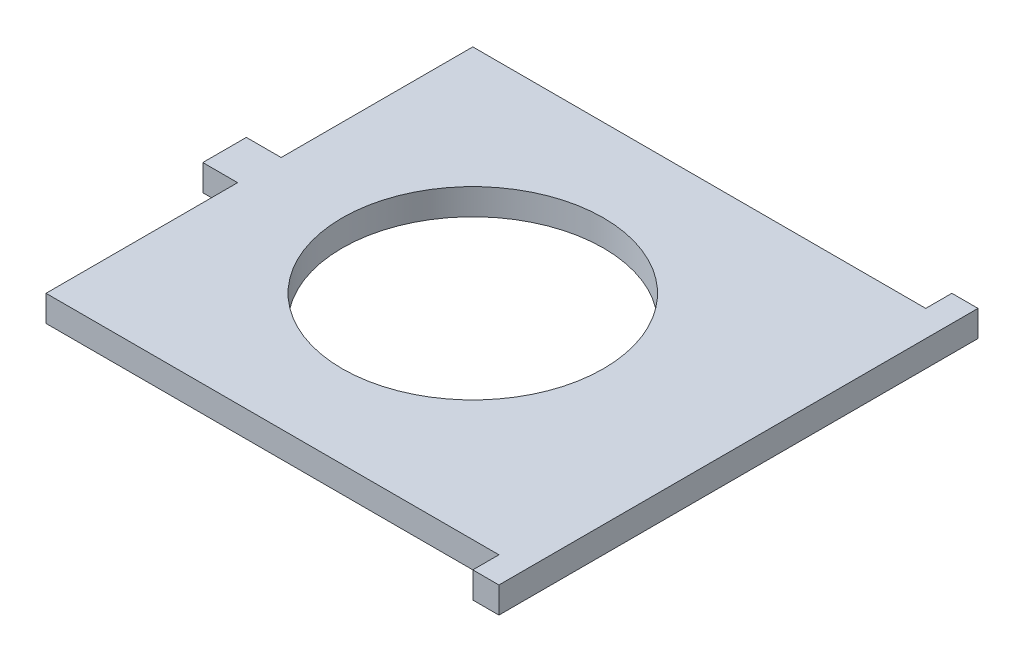
ISO-10303-21;
HEADER;
FILE_DESCRIPTION(('STEP AP214'),'2;1');
FILE_NAME('part.step','',(''),(''),'','','');
FILE_SCHEMA(('AUTOMOTIVE_DESIGN { 1 0 10303 214 1 1 1 1 }'));
ENDSEC;
DATA;
#1=APPLICATION_CONTEXT('core data for automotive mechanical design processes');
#2=APPLICATION_PROTOCOL_DEFINITION('international standard','automotive_design',2000,#1);
#3=PRODUCT_CONTEXT('',#1,'mechanical');
#4=PRODUCT('Part','Part','',(#3));
#5=PRODUCT_RELATED_PRODUCT_CATEGORY('part','',(#4));
#6=PRODUCT_DEFINITION_FORMATION('','',#4);
#7=PRODUCT_DEFINITION_CONTEXT('part definition',#1,'design');
#8=PRODUCT_DEFINITION('design','',#6,#7);
#9=PRODUCT_DEFINITION_SHAPE('','',#8);
#10=(LENGTH_UNIT() NAMED_UNIT(*) SI_UNIT(.MILLI.,.METRE.));
#11=(NAMED_UNIT(*) PLANE_ANGLE_UNIT() SI_UNIT($,.RADIAN.));
#12=(NAMED_UNIT(*) SI_UNIT($,.STERADIAN.) SOLID_ANGLE_UNIT());
#13=UNCERTAINTY_MEASURE_WITH_UNIT(LENGTH_MEASURE(1.E-05),#10,'distance_accuracy_value','');
#14=(GEOMETRIC_REPRESENTATION_CONTEXT(3) GLOBAL_UNCERTAINTY_ASSIGNED_CONTEXT((#13)) GLOBAL_UNIT_ASSIGNED_CONTEXT((#10,
#11,#12)) REPRESENTATION_CONTEXT('',''));
#15=CARTESIAN_POINT('',(0.,0.,0.));
#16=DIRECTION('',(0.,0.,1.));
#17=DIRECTION('',(1.,0.,0.));
#18=AXIS2_PLACEMENT_3D('',#15,#16,#17);
#19=CARTESIAN_POINT('',(0.,3.,24.5));
#20=DIRECTION('',(0.,0.,-1.));
#21=DIRECTION('',(-1.,0.,0.));
#22=AXIS2_PLACEMENT_3D('',#19,#20,#21);
#23=PLANE('',#22);
#24=DIRECTION('',(1.,0.,0.));
#25=VECTOR('',#24,1.);
#26=CARTESIAN_POINT('',(0.,0.,24.5));
#27=LINE('',#26,#25);
#28=CARTESIAN_POINT('',(-24.5,0.,24.5));
#29=VERTEX_POINT('',#28);
#30=CARTESIAN_POINT('',(27.5,0.,24.5));
#31=VERTEX_POINT('',#30);
#32=EDGE_CURVE('E163',#29,#31,#27,.T.);
#33=ORIENTED_EDGE('',*,*,#32,.T.);
#34=DIRECTION('',(0.,-1.,0.));
#35=VECTOR('',#34,1.);
#36=CARTESIAN_POINT('',(27.5,3.,24.5));
#37=LINE('',#36,#35);
#38=CARTESIAN_POINT('',(27.5,3.,24.5));
#39=VERTEX_POINT('',#38);
#40=EDGE_CURVE('E11',#39,#31,#37,.T.);
#41=ORIENTED_EDGE('',*,*,#40,.F.);
#42=DIRECTION('',(1.,0.,0.));
#43=VECTOR('',#42,1.);
#44=CARTESIAN_POINT('',(0.,3.,24.5));
#45=LINE('',#44,#43);
#46=CARTESIAN_POINT('',(-24.5,3.,24.5));
#47=VERTEX_POINT('',#46);
#48=EDGE_CURVE('E448',#47,#39,#45,.T.);
#49=ORIENTED_EDGE('',*,*,#48,.F.);
#50=DIRECTION('',(0.,-1.,0.));
#51=VECTOR('',#50,1.);
#52=CARTESIAN_POINT('',(-24.5,3.,24.5));
#53=LINE('',#52,#51);
#54=EDGE_CURVE('E54',#47,#29,#53,.T.);
#55=ORIENTED_EDGE('',*,*,#54,.T.);
#56=EDGE_LOOP('',(#33,#41,#49,#55));
#57=FACE_BOUND('',#56,.T.);
#58=ADVANCED_FACE('F37',(#57),#23,.F.);
#59=CARTESIAN_POINT('',(27.5,3.,0.));
#60=DIRECTION('',(1.,0.,0.));
#61=DIRECTION('',(0.,0.,-1.));
#62=AXIS2_PLACEMENT_3D('',#59,#60,#61);
#63=PLANE('',#62);
#64=DIRECTION('',(0.,0.,1.));
#65=VECTOR('',#64,1.);
#66=CARTESIAN_POINT('',(27.5,0.,0.));
#67=LINE('',#66,#65);
#68=CARTESIAN_POINT('',(27.5,0.,27.5));
#69=VERTEX_POINT('',#68);
#70=EDGE_CURVE('E165',#31,#69,#67,.T.);
#71=ORIENTED_EDGE('',*,*,#70,.T.);
#72=DIRECTION('',(0.,-1.,0.));
#73=VECTOR('',#72,1.);
#74=CARTESIAN_POINT('',(27.5,3.,27.5));
#75=LINE('',#74,#73);
#76=CARTESIAN_POINT('',(27.5,3.,27.5));
#77=VERTEX_POINT('',#76);
#78=EDGE_CURVE('E46',#77,#69,#75,.T.);
#79=ORIENTED_EDGE('',*,*,#78,.F.);
#80=DIRECTION('',(0.,0.,1.));
#81=VECTOR('',#80,1.);
#82=CARTESIAN_POINT('',(27.5,3.,0.));
#83=LINE('',#82,#81);
#84=EDGE_CURVE('E104',#39,#77,#83,.T.);
#85=ORIENTED_EDGE('',*,*,#84,.F.);
#86=ORIENTED_EDGE('',*,*,#40,.T.);
#87=EDGE_LOOP('',(#71,#79,#85,#86));
#88=FACE_BOUND('',#87,.T.);
#89=ADVANCED_FACE('F259',(#88),#63,.F.);
#90=CARTESIAN_POINT('',(0.,3.,27.5));
#91=DIRECTION('',(0.,0.,-1.));
#92=DIRECTION('',(-1.,0.,0.));
#93=AXIS2_PLACEMENT_3D('',#90,#91,#92);
#94=PLANE('',#93);
#95=DIRECTION('',(1.,0.,0.));
#96=VECTOR('',#95,1.);
#97=CARTESIAN_POINT('',(0.,0.,27.5));
#98=LINE('',#97,#96);
#99=CARTESIAN_POINT('',(30.5,0.,27.5));
#100=VERTEX_POINT('',#99);
#101=EDGE_CURVE('E167',#69,#100,#98,.T.);
#102=ORIENTED_EDGE('',*,*,#101,.T.);
#103=DIRECTION('',(0.,-1.,0.));
#104=VECTOR('',#103,1.);
#105=CARTESIAN_POINT('',(30.5,3.,27.5));
#106=LINE('',#105,#104);
#107=CARTESIAN_POINT('',(30.5,3.,27.5));
#108=VERTEX_POINT('',#107);
#109=EDGE_CURVE('E202',#108,#100,#106,.T.);
#110=ORIENTED_EDGE('',*,*,#109,.F.);
#111=DIRECTION('',(1.,0.,0.));
#112=VECTOR('',#111,1.);
#113=CARTESIAN_POINT('',(0.,3.,27.5));
#114=LINE('',#113,#112);
#115=EDGE_CURVE('E210',#77,#108,#114,.T.);
#116=ORIENTED_EDGE('',*,*,#115,.F.);
#117=ORIENTED_EDGE('',*,*,#78,.T.);
#118=EDGE_LOOP('',(#102,#110,#116,#117));
#119=FACE_BOUND('',#118,.T.);
#120=ADVANCED_FACE('F208',(#119),#94,.F.);
#121=CARTESIAN_POINT('',(30.5,3.,0.));
#122=DIRECTION('',(-1.,0.,0.));
#123=DIRECTION('',(0.,0.,1.));
#124=AXIS2_PLACEMENT_3D('',#121,#122,#123);
#125=PLANE('',#124);
#126=DIRECTION('',(0.,0.,-1.));
#127=VECTOR('',#126,1.);
#128=CARTESIAN_POINT('',(30.5,0.,0.));
#129=LINE('',#128,#127);
#130=CARTESIAN_POINT('',(30.5,0.,-27.5));
#131=VERTEX_POINT('',#130);
#132=EDGE_CURVE('E170',#100,#131,#129,.T.);
#133=ORIENTED_EDGE('',*,*,#132,.T.);
#134=DIRECTION('',(0.,-1.,0.));
#135=VECTOR('',#134,1.);
#136=CARTESIAN_POINT('',(30.5,3.,-27.5));
#137=LINE('',#136,#135);
#138=CARTESIAN_POINT('',(30.5,3.,-27.5));
#139=VERTEX_POINT('',#138);
#140=EDGE_CURVE('E199',#139,#131,#137,.T.);
#141=ORIENTED_EDGE('',*,*,#140,.F.);
#142=DIRECTION('',(0.,0.,-1.));
#143=VECTOR('',#142,1.);
#144=CARTESIAN_POINT('',(30.5,3.,0.));
#145=LINE('',#144,#143);
#146=EDGE_CURVE('E227',#108,#139,#145,.T.);
#147=ORIENTED_EDGE('',*,*,#146,.F.);
#148=ORIENTED_EDGE('',*,*,#109,.T.);
#149=EDGE_LOOP('',(#133,#141,#147,#148));
#150=FACE_BOUND('',#149,.T.);
#151=ADVANCED_FACE('F218',(#150),#125,.F.);
#152=CARTESIAN_POINT('',(0.,3.,-27.5));
#153=DIRECTION('',(0.,0.,1.));
#154=DIRECTION('',(1.,0.,0.));
#155=AXIS2_PLACEMENT_3D('',#152,#153,#154);
#156=PLANE('',#155);
#157=DIRECTION('',(-1.,0.,0.));
#158=VECTOR('',#157,1.);
#159=CARTESIAN_POINT('',(0.,0.,-27.5));
#160=LINE('',#159,#158);
#161=CARTESIAN_POINT('',(27.5,0.,-27.5));
#162=VERTEX_POINT('',#161);
#163=EDGE_CURVE('E172',#131,#162,#160,.T.);
#164=ORIENTED_EDGE('',*,*,#163,.T.);
#165=DIRECTION('',(0.,-1.,0.));
#166=VECTOR('',#165,1.);
#167=CARTESIAN_POINT('',(27.5,3.,-27.5));
#168=LINE('',#167,#166);
#169=CARTESIAN_POINT('',(27.5,3.,-27.5));
#170=VERTEX_POINT('',#169);
#171=EDGE_CURVE('E196',#170,#162,#168,.T.);
#172=ORIENTED_EDGE('',*,*,#171,.F.);
#173=DIRECTION('',(-1.,0.,0.));
#174=VECTOR('',#173,1.);
#175=CARTESIAN_POINT('',(0.,3.,-27.5));
#176=LINE('',#175,#174);
#177=EDGE_CURVE('E224',#139,#170,#176,.T.);
#178=ORIENTED_EDGE('',*,*,#177,.F.);
#179=ORIENTED_EDGE('',*,*,#140,.T.);
#180=EDGE_LOOP('',(#164,#172,#178,#179));
#181=FACE_BOUND('',#180,.T.);
#182=ADVANCED_FACE('F222',(#181),#156,.F.);
#183=CARTESIAN_POINT('',(27.5,0.,-24.5));
#184=VERTEX_POINT('',#183);
#185=EDGE_CURVE('E168',#162,#184,#67,.T.);
#186=ORIENTED_EDGE('',*,*,#185,.T.);
#187=DIRECTION('',(0.,-1.,0.));
#188=VECTOR('',#187,1.);
#189=CARTESIAN_POINT('',(27.5,3.,-24.5));
#190=LINE('',#189,#188);
#191=CARTESIAN_POINT('',(27.5,3.,-24.5));
#192=VERTEX_POINT('',#191);
#193=EDGE_CURVE('E194',#192,#184,#190,.T.);
#194=ORIENTED_EDGE('',*,*,#193,.F.);
#195=EDGE_CURVE('E226',#170,#192,#83,.T.);
#196=ORIENTED_EDGE('',*,*,#195,.F.);
#197=ORIENTED_EDGE('',*,*,#171,.T.);
#198=EDGE_LOOP('',(#186,#194,#196,#197));
#199=FACE_BOUND('',#198,.T.);
#200=ADVANCED_FACE('F264',(#199),#63,.F.);
#201=CARTESIAN_POINT('',(0.,3.,-24.5));
#202=DIRECTION('',(0.,0.,-1.));
#203=DIRECTION('',(-1.,0.,0.));
#204=AXIS2_PLACEMENT_3D('',#201,#202,#203);
#205=PLANE('',#204);
#206=DIRECTION('',(1.,0.,0.));
#207=VECTOR('',#206,1.);
#208=CARTESIAN_POINT('',(0.,0.,-24.5));
#209=LINE('',#208,#207);
#210=CARTESIAN_POINT('',(-24.5,0.,-24.5));
#211=VERTEX_POINT('',#210);
#212=EDGE_CURVE('E174',#211,#184,#209,.T.);
#213=ORIENTED_EDGE('',*,*,#212,.F.);
#214=DIRECTION('',(0.,-1.,0.));
#215=VECTOR('',#214,1.);
#216=CARTESIAN_POINT('',(-24.5,3.,-24.5));
#217=LINE('',#216,#215);
#218=CARTESIAN_POINT('',(-24.5,3.,-24.5));
#219=VERTEX_POINT('',#218);
#220=EDGE_CURVE('E192',#219,#211,#217,.T.);
#221=ORIENTED_EDGE('',*,*,#220,.F.);
#222=DIRECTION('',(1.,0.,0.));
#223=VECTOR('',#222,1.);
#224=CARTESIAN_POINT('',(0.,3.,-24.5));
#225=LINE('',#224,#223);
#226=EDGE_CURVE('E229',#219,#192,#225,.T.);
#227=ORIENTED_EDGE('',*,*,#226,.T.);
#228=ORIENTED_EDGE('',*,*,#193,.T.);
#229=EDGE_LOOP('',(#213,#221,#227,#228));
#230=FACE_BOUND('',#229,.T.);
#231=ADVANCED_FACE('F243',(#230),#205,.T.);
#232=CARTESIAN_POINT('',(-24.5,3.,0.));
#233=DIRECTION('',(-1.,0.,0.));
#234=DIRECTION('',(0.,0.,1.));
#235=AXIS2_PLACEMENT_3D('',#232,#233,#234);
#236=PLANE('',#235);
#237=DIRECTION('',(0.,0.,-1.));
#238=VECTOR('',#237,1.);
#239=CARTESIAN_POINT('',(-24.5,0.,0.));
#240=LINE('',#239,#238);
#241=CARTESIAN_POINT('',(-24.5,0.,-2.5));
#242=VERTEX_POINT('',#241);
#243=EDGE_CURVE('E177',#242,#211,#240,.T.);
#244=ORIENTED_EDGE('',*,*,#243,.F.);
#245=DIRECTION('',(0.,-1.,0.));
#246=VECTOR('',#245,1.);
#247=CARTESIAN_POINT('',(-24.5,3.,-2.5));
#248=LINE('',#247,#246);
#249=CARTESIAN_POINT('',(-24.5,3.,-2.5));
#250=VERTEX_POINT('',#249);
#251=EDGE_CURVE('E190',#250,#242,#248,.T.);
#252=ORIENTED_EDGE('',*,*,#251,.F.);
#253=DIRECTION('',(0.,0.,-1.));
#254=VECTOR('',#253,1.);
#255=CARTESIAN_POINT('',(-24.5,3.,0.));
#256=LINE('',#255,#254);
#257=EDGE_CURVE('E157',#250,#219,#256,.T.);
#258=ORIENTED_EDGE('',*,*,#257,.T.);
#259=ORIENTED_EDGE('',*,*,#220,.T.);
#260=EDGE_LOOP('',(#244,#252,#258,#259));
#261=FACE_BOUND('',#260,.T.);
#262=ADVANCED_FACE('F238',(#261),#236,.T.);
#263=CARTESIAN_POINT('',(0.,3.,-2.50000000000001));
#264=DIRECTION('',(0.,0.,1.));
#265=DIRECTION('',(1.,0.,0.));
#266=AXIS2_PLACEMENT_3D('',#263,#264,#265);
#267=PLANE('',#266);
#268=DIRECTION('',(-1.,0.,0.));
#269=VECTOR('',#268,1.);
#270=CARTESIAN_POINT('',(0.,0.,-2.50000000000001));
#271=LINE('',#270,#269);
#272=CARTESIAN_POINT('',(-28.5,0.,-2.5));
#273=VERTEX_POINT('',#272);
#274=EDGE_CURVE('E180',#242,#273,#271,.T.);
#275=ORIENTED_EDGE('',*,*,#274,.T.);
#276=DIRECTION('',(0.,-1.,0.));
#277=VECTOR('',#276,1.);
#278=CARTESIAN_POINT('',(-28.5,3.,-2.5));
#279=LINE('',#278,#277);
#280=CARTESIAN_POINT('',(-28.5,3.,-2.5));
#281=VERTEX_POINT('',#280);
#282=EDGE_CURVE('E141',#281,#273,#279,.T.);
#283=ORIENTED_EDGE('',*,*,#282,.F.);
#284=DIRECTION('',(-1.,0.,0.));
#285=VECTOR('',#284,1.);
#286=CARTESIAN_POINT('',(0.,3.,-2.50000000000001));
#287=LINE('',#286,#285);
#288=EDGE_CURVE('E150',#250,#281,#287,.T.);
#289=ORIENTED_EDGE('',*,*,#288,.F.);
#290=ORIENTED_EDGE('',*,*,#251,.T.);
#291=EDGE_LOOP('',(#275,#283,#289,#290));
#292=FACE_BOUND('',#291,.T.);
#293=ADVANCED_FACE('F247',(#292),#267,.F.);
#294=CARTESIAN_POINT('',(-28.5,3.,0.));
#295=DIRECTION('',(-1.,0.,0.));
#296=DIRECTION('',(0.,0.,1.));
#297=AXIS2_PLACEMENT_3D('',#294,#295,#296);
#298=PLANE('',#297);
#299=DIRECTION('',(0.,0.,-1.));
#300=VECTOR('',#299,1.);
#301=CARTESIAN_POINT('',(-28.5,0.,0.));
#302=LINE('',#301,#300);
#303=CARTESIAN_POINT('',(-28.5,0.,2.5));
#304=VERTEX_POINT('',#303);
#305=EDGE_CURVE('E137',#304,#273,#302,.T.);
#306=ORIENTED_EDGE('',*,*,#305,.F.);
#307=DIRECTION('',(0.,-1.,0.));
#308=VECTOR('',#307,1.);
#309=CARTESIAN_POINT('',(-28.5,3.,2.5));
#310=LINE('',#309,#308);
#311=CARTESIAN_POINT('',(-28.5,3.,2.5));
#312=VERTEX_POINT('',#311);
#313=EDGE_CURVE('E132',#312,#304,#310,.T.);
#314=ORIENTED_EDGE('',*,*,#313,.F.);
#315=DIRECTION('',(0.,0.,-1.));
#316=VECTOR('',#315,1.);
#317=CARTESIAN_POINT('',(-28.5,3.,0.));
#318=LINE('',#317,#316);
#319=EDGE_CURVE('E135',#312,#281,#318,.T.);
#320=ORIENTED_EDGE('',*,*,#319,.T.);
#321=ORIENTED_EDGE('',*,*,#282,.T.);
#322=EDGE_LOOP('',(#306,#314,#320,#321));
#323=FACE_BOUND('',#322,.T.);
#324=ADVANCED_FACE('F134',(#323),#298,.T.);
#325=CARTESIAN_POINT('',(0.,3.,2.5));
#326=DIRECTION('',(0.,0.,1.));
#327=DIRECTION('',(1.,0.,0.));
#328=AXIS2_PLACEMENT_3D('',#325,#326,#327);
#329=PLANE('',#328);
#330=DIRECTION('',(-1.,0.,0.));
#331=VECTOR('',#330,1.);
#332=CARTESIAN_POINT('',(0.,0.,2.5));
#333=LINE('',#332,#331);
#334=CARTESIAN_POINT('',(-24.5,0.,2.5));
#335=VERTEX_POINT('',#334);
#336=EDGE_CURVE('E185',#335,#304,#333,.T.);
#337=ORIENTED_EDGE('',*,*,#336,.F.);
#338=DIRECTION('',(0.,-1.,0.));
#339=VECTOR('',#338,1.);
#340=CARTESIAN_POINT('',(-24.5,3.,2.5));
#341=LINE('',#340,#339);
#342=CARTESIAN_POINT('',(-24.5,3.,2.5));
#343=VERTEX_POINT('',#342);
#344=EDGE_CURVE('E92',#343,#335,#341,.T.);
#345=ORIENTED_EDGE('',*,*,#344,.F.);
#346=DIRECTION('',(-1.,0.,0.));
#347=VECTOR('',#346,1.);
#348=CARTESIAN_POINT('',(0.,3.,2.5));
#349=LINE('',#348,#347);
#350=EDGE_CURVE('E147',#343,#312,#349,.T.);
#351=ORIENTED_EDGE('',*,*,#350,.T.);
#352=ORIENTED_EDGE('',*,*,#313,.T.);
#353=EDGE_LOOP('',(#337,#345,#351,#352));
#354=FACE_BOUND('',#353,.T.);
#355=ADVANCED_FACE('F153',(#354),#329,.T.);
#356=CARTESIAN_POINT('',(0.,3.,0.));
#357=DIRECTION('',(0.,-1.,0.));
#358=DIRECTION('',(0.,0.,-1.));
#359=AXIS2_PLACEMENT_3D('',#356,#357,#358);
#360=CYLINDRICAL_SURFACE('',#359,15.);
#361=CARTESIAN_POINT('',(0.,3.,0.));
#362=DIRECTION('',(0.,1.,0.));
#363=DIRECTION('',(0.,0.,1.));
#364=AXIS2_PLACEMENT_3D('',#361,#362,#363);
#365=CIRCLE('',#364,15.);
#366=CARTESIAN_POINT('',(0.,3.,15.));
#367=VERTEX_POINT('',#366);
#368=EDGE_CURVE('E447',#367,#367,#365,.T.);
#369=ORIENTED_EDGE('',*,*,#368,.T.);
#370=EDGE_LOOP('',(#369));
#371=FACE_BOUND('',#370,.T.);
#372=CARTESIAN_POINT('',(0.,0.,0.));
#373=DIRECTION('',(0.,1.,0.));
#374=DIRECTION('',(0.,0.,1.));
#375=AXIS2_PLACEMENT_3D('',#372,#373,#374);
#376=CIRCLE('',#375,15.);
#377=CARTESIAN_POINT('',(0.,0.,15.));
#378=VERTEX_POINT('',#377);
#379=EDGE_CURVE('E160',#378,#378,#376,.T.);
#380=ORIENTED_EDGE('',*,*,#379,.F.);
#381=EDGE_LOOP('',(#380));
#382=FACE_BOUND('',#381,.T.);
#383=ADVANCED_FACE('F39',(#371,#382),#360,.F.);
#384=EDGE_CURVE('E181',#29,#335,#240,.T.);
#385=ORIENTED_EDGE('',*,*,#384,.F.);
#386=ORIENTED_EDGE('',*,*,#54,.F.);
#387=EDGE_CURVE('E154',#47,#343,#256,.T.);
#388=ORIENTED_EDGE('',*,*,#387,.T.);
#389=ORIENTED_EDGE('',*,*,#344,.T.);
#390=EDGE_LOOP('',(#385,#386,#388,#389));
#391=FACE_BOUND('',#390,.T.);
#392=ADVANCED_FACE('F256',(#391),#236,.T.);
#393=CARTESIAN_POINT('',(0.,3.,0.));
#394=DIRECTION('',(0.,1.,0.));
#395=DIRECTION('',(0.,0.,1.));
#396=AXIS2_PLACEMENT_3D('',#393,#394,#395);
#397=PLANE('',#396);
#398=ORIENTED_EDGE('',*,*,#368,.F.);
#399=EDGE_LOOP('',(#398));
#400=FACE_BOUND('',#399,.T.);
#401=ORIENTED_EDGE('',*,*,#48,.T.);
#402=ORIENTED_EDGE('',*,*,#84,.T.);
#403=ORIENTED_EDGE('',*,*,#115,.T.);
#404=ORIENTED_EDGE('',*,*,#146,.T.);
#405=ORIENTED_EDGE('',*,*,#177,.T.);
#406=ORIENTED_EDGE('',*,*,#195,.T.);
#407=ORIENTED_EDGE('',*,*,#226,.F.);
#408=ORIENTED_EDGE('',*,*,#257,.F.);
#409=ORIENTED_EDGE('',*,*,#288,.T.);
#410=ORIENTED_EDGE('',*,*,#319,.F.);
#411=ORIENTED_EDGE('',*,*,#350,.F.);
#412=ORIENTED_EDGE('',*,*,#387,.F.);
#413=EDGE_LOOP('',(#401,#402,#403,#404,#405,#406,#407,#408,#409,#410,#411,#412));
#414=FACE_BOUND('',#413,.T.);
#415=ADVANCED_FACE('F145',(#400,#414),#397,.T.);
#416=CARTESIAN_POINT('',(0.,0.,0.));
#417=DIRECTION('',(0.,1.,0.));
#418=DIRECTION('',(0.,0.,1.));
#419=AXIS2_PLACEMENT_3D('',#416,#417,#418);
#420=PLANE('',#419);
#421=ORIENTED_EDGE('',*,*,#379,.T.);
#422=EDGE_LOOP('',(#421));
#423=FACE_BOUND('',#422,.T.);
#424=ORIENTED_EDGE('',*,*,#32,.F.);
#425=ORIENTED_EDGE('',*,*,#384,.T.);
#426=ORIENTED_EDGE('',*,*,#336,.T.);
#427=ORIENTED_EDGE('',*,*,#305,.T.);
#428=ORIENTED_EDGE('',*,*,#274,.F.);
#429=ORIENTED_EDGE('',*,*,#243,.T.);
#430=ORIENTED_EDGE('',*,*,#212,.T.);
#431=ORIENTED_EDGE('',*,*,#185,.F.);
#432=ORIENTED_EDGE('',*,*,#163,.F.);
#433=ORIENTED_EDGE('',*,*,#132,.F.);
#434=ORIENTED_EDGE('',*,*,#101,.F.);
#435=ORIENTED_EDGE('',*,*,#70,.F.);
#436=EDGE_LOOP('',(#424,#425,#426,#427,#428,#429,#430,#431,#432,#433,#434,#435));
#437=FACE_BOUND('',#436,.T.);
#438=ADVANCED_FACE('F213',(#423,#437),#420,.F.);
#439=CLOSED_SHELL('',(#58,#89,#120,#151,#182,#200,#231,#262,#293,#324,#355,#383,#392,#415,#438));
#440=MANIFOLD_SOLID_BREP('B2',#439);
#441=ADVANCED_BREP_SHAPE_REPRESENTATION('',(#18,#440),#14);
#442=SHAPE_DEFINITION_REPRESENTATION(#9,#441);
ENDSEC;
END-ISO-10303-21;
